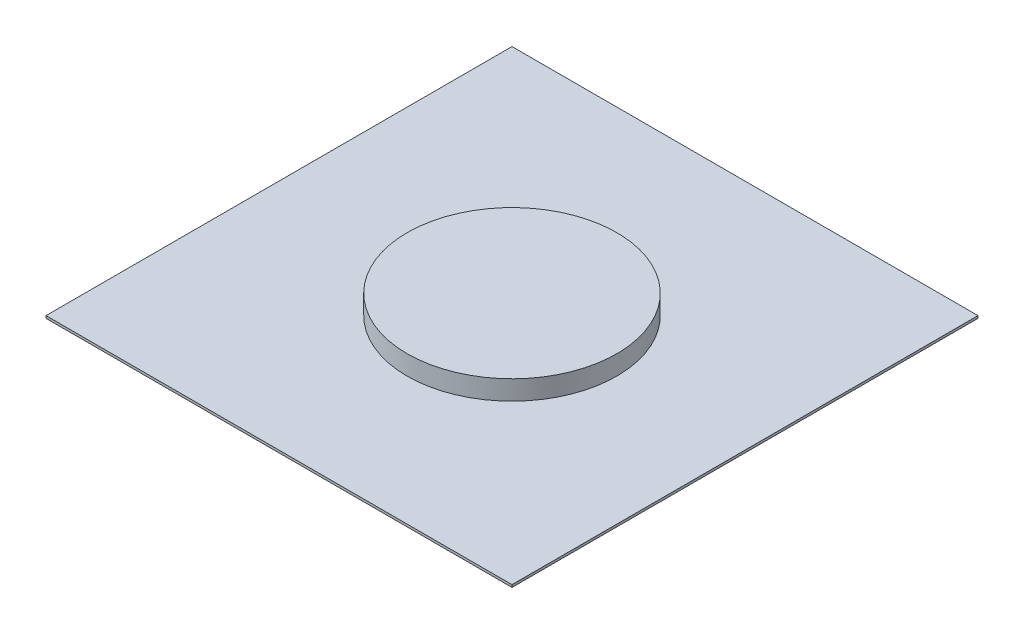
ISO-10303-21;
HEADER;
FILE_DESCRIPTION(('STEP AP214'),'2;1');
FILE_NAME('part.step','',(''),(''),'','','');
FILE_SCHEMA(('AUTOMOTIVE_DESIGN { 1 0 10303 214 1 1 1 1 }'));
ENDSEC;
DATA;
#1=APPLICATION_CONTEXT('core data for automotive mechanical design processes');
#2=APPLICATION_PROTOCOL_DEFINITION('international standard','automotive_design',2000,#1);
#3=PRODUCT_CONTEXT('',#1,'mechanical');
#4=PRODUCT('Part','Part','',(#3));
#5=PRODUCT_RELATED_PRODUCT_CATEGORY('part','',(#4));
#6=PRODUCT_DEFINITION_FORMATION('','',#4);
#7=PRODUCT_DEFINITION_CONTEXT('part definition',#1,'design');
#8=PRODUCT_DEFINITION('design','',#6,#7);
#9=PRODUCT_DEFINITION_SHAPE('','',#8);
#10=(LENGTH_UNIT() NAMED_UNIT(*) SI_UNIT(.MILLI.,.METRE.));
#11=(NAMED_UNIT(*) PLANE_ANGLE_UNIT() SI_UNIT($,.RADIAN.));
#12=(NAMED_UNIT(*) SI_UNIT($,.STERADIAN.) SOLID_ANGLE_UNIT());
#13=UNCERTAINTY_MEASURE_WITH_UNIT(LENGTH_MEASURE(1.E-05),#10,'distance_accuracy_value','');
#14=(GEOMETRIC_REPRESENTATION_CONTEXT(3) GLOBAL_UNCERTAINTY_ASSIGNED_CONTEXT((#13)) GLOBAL_UNIT_ASSIGNED_CONTEXT((#10,
#11,#12)) REPRESENTATION_CONTEXT('',''));
#15=CARTESIAN_POINT('',(0.,0.,0.));
#16=DIRECTION('',(0.,0.,1.));
#17=DIRECTION('',(1.,0.,0.));
#18=AXIS2_PLACEMENT_3D('',#15,#16,#17);
#19=CARTESIAN_POINT('',(0.,25.4,0.));
#20=DIRECTION('',(0.,-1.,0.));
#21=DIRECTION('',(0.,0.,-1.));
#22=AXIS2_PLACEMENT_3D('',#19,#20,#21);
#23=CYLINDRICAL_SURFACE('',#22,137.175010905379);
#24=CARTESIAN_POINT('',(0.,25.4,0.));
#25=DIRECTION('',(0.,1.,0.));
#26=DIRECTION('',(0.,0.,1.));
#27=AXIS2_PLACEMENT_3D('',#24,#25,#26);
#28=CIRCLE('',#27,137.175010905379);
#29=CARTESIAN_POINT('',(0.,25.4,137.175010905379));
#30=VERTEX_POINT('',#29);
#31=EDGE_CURVE('E11',#30,#30,#28,.T.);
#32=ORIENTED_EDGE('',*,*,#31,.F.);
#33=EDGE_LOOP('',(#32));
#34=FACE_BOUND('',#33,.T.);
#35=CARTESIAN_POINT('',(0.,0.,0.));
#36=DIRECTION('',(0.,1.,0.));
#37=DIRECTION('',(0.,0.,1.));
#38=AXIS2_PLACEMENT_3D('',#35,#36,#37);
#39=CIRCLE('',#38,137.175010905379);
#40=CARTESIAN_POINT('',(0.,0.,137.175010905379));
#41=VERTEX_POINT('',#40);
#42=EDGE_CURVE('E374',#41,#41,#39,.T.);
#43=ORIENTED_EDGE('',*,*,#42,.T.);
#44=EDGE_LOOP('',(#43));
#45=FACE_BOUND('',#44,.T.);
#46=ADVANCED_FACE('F368',(#34,#45),#23,.T.);
#47=CARTESIAN_POINT('',(0.,25.4,0.));
#48=DIRECTION('',(0.,1.,0.));
#49=DIRECTION('',(0.,0.,1.));
#50=AXIS2_PLACEMENT_3D('',#47,#48,#49);
#51=PLANE('',#50);
#52=ORIENTED_EDGE('',*,*,#31,.T.);
#53=EDGE_LOOP('',(#52));
#54=FACE_BOUND('',#53,.T.);
#55=ADVANCED_FACE('F383',(#54),#51,.T.);
#56=CARTESIAN_POINT('',(0.,0.,0.));
#57=DIRECTION('',(0.,1.,0.));
#58=DIRECTION('',(0.,0.,1.));
#59=AXIS2_PLACEMENT_3D('',#56,#57,#58);
#60=PLANE('',#59);
#61=ORIENTED_EDGE('',*,*,#42,.F.);
#62=EDGE_LOOP('',(#61));
#63=FACE_BOUND('',#62,.T.);
#64=ADVANCED_FACE('F381',(#63),#60,.F.);
#65=CLOSED_SHELL('',(#46,#55,#64));
#66=MANIFOLD_SOLID_BREP('B2',#65);
#67=CARTESIAN_POINT('',(-304.8,-3.175,-304.8));
#68=DIRECTION('',(-1.,0.,0.));
#69=DIRECTION('',(0.,0.,1.));
#70=AXIS2_PLACEMENT_3D('',#67,#68,#69);
#71=PLANE('',#70);
#72=DIRECTION('',(0.,0.,1.));
#73=VECTOR('',#72,1.);
#74=CARTESIAN_POINT('',(-304.8,0.,-304.8));
#75=LINE('',#74,#73);
#76=CARTESIAN_POINT('',(-304.8,0.,-304.8));
#77=VERTEX_POINT('',#76);
#78=CARTESIAN_POINT('',(-304.8,0.,304.8));
#79=VERTEX_POINT('',#78);
#80=EDGE_CURVE('E442',#77,#79,#75,.T.);
#81=ORIENTED_EDGE('',*,*,#80,.F.);
#82=DIRECTION('',(0.,1.,0.));
#83=VECTOR('',#82,1.);
#84=CARTESIAN_POINT('',(-304.8,-3.175,-304.8));
#85=LINE('',#84,#83);
#86=CARTESIAN_POINT('',(-304.8,-3.175,-304.8));
#87=VERTEX_POINT('',#86);
#88=EDGE_CURVE('E366',#87,#77,#85,.T.);
#89=ORIENTED_EDGE('',*,*,#88,.F.);
#90=DIRECTION('',(0.,0.,1.));
#91=VECTOR('',#90,1.);
#92=CARTESIAN_POINT('',(-304.8,-3.175,-304.8));
#93=LINE('',#92,#91);
#94=CARTESIAN_POINT('',(-304.8,-3.175,304.8));
#95=VERTEX_POINT('',#94);
#96=EDGE_CURVE('E444',#87,#95,#93,.T.);
#97=ORIENTED_EDGE('',*,*,#96,.T.);
#98=DIRECTION('',(0.,1.,0.));
#99=VECTOR('',#98,1.);
#100=CARTESIAN_POINT('',(-304.8,-3.175,304.8));
#101=LINE('',#100,#99);
#102=EDGE_CURVE('E405',#95,#79,#101,.T.);
#103=ORIENTED_EDGE('',*,*,#102,.T.);
#104=EDGE_LOOP('',(#81,#89,#97,#103));
#105=FACE_BOUND('',#104,.T.);
#106=ADVANCED_FACE('F402',(#105),#71,.T.);
#107=CARTESIAN_POINT('',(-304.8,-3.175,-304.8));
#108=DIRECTION('',(0.,0.,-1.));
#109=DIRECTION('',(-1.,0.,0.));
#110=AXIS2_PLACEMENT_3D('',#107,#108,#109);
#111=PLANE('',#110);
#112=DIRECTION('',(-1.,0.,0.));
#113=VECTOR('',#112,1.);
#114=CARTESIAN_POINT('',(-304.8,0.,-304.8));
#115=LINE('',#114,#113);
#116=CARTESIAN_POINT('',(304.8,0.,-304.8));
#117=VERTEX_POINT('',#116);
#118=EDGE_CURVE('E459',#117,#77,#115,.T.);
#119=ORIENTED_EDGE('',*,*,#118,.F.);
#120=DIRECTION('',(0.,1.,0.));
#121=VECTOR('',#120,1.);
#122=CARTESIAN_POINT('',(304.8,-3.175,-304.8));
#123=LINE('',#122,#121);
#124=CARTESIAN_POINT('',(304.8,-3.175,-304.8));
#125=VERTEX_POINT('',#124);
#126=EDGE_CURVE('E410',#125,#117,#123,.T.);
#127=ORIENTED_EDGE('',*,*,#126,.F.);
#128=DIRECTION('',(-1.,0.,0.));
#129=VECTOR('',#128,1.);
#130=CARTESIAN_POINT('',(-304.8,-3.175,-304.8));
#131=LINE('',#130,#129);
#132=EDGE_CURVE('E449',#125,#87,#131,.T.);
#133=ORIENTED_EDGE('',*,*,#132,.T.);
#134=ORIENTED_EDGE('',*,*,#88,.T.);
#135=EDGE_LOOP('',(#119,#127,#133,#134));
#136=FACE_BOUND('',#135,.T.);
#137=ADVANCED_FACE('F474',(#136),#111,.T.);
#138=CARTESIAN_POINT('',(304.8,-3.175,-304.8));
#139=DIRECTION('',(1.,0.,0.));
#140=DIRECTION('',(0.,0.,-1.));
#141=AXIS2_PLACEMENT_3D('',#138,#139,#140);
#142=PLANE('',#141);
#143=DIRECTION('',(0.,0.,-1.));
#144=VECTOR('',#143,1.);
#145=CARTESIAN_POINT('',(304.8,0.,-304.8));
#146=LINE('',#145,#144);
#147=CARTESIAN_POINT('',(304.8,0.,304.8));
#148=VERTEX_POINT('',#147);
#149=EDGE_CURVE('E456',#148,#117,#146,.T.);
#150=ORIENTED_EDGE('',*,*,#149,.F.);
#151=DIRECTION('',(0.,1.,0.));
#152=VECTOR('',#151,1.);
#153=CARTESIAN_POINT('',(304.8,-3.175,304.8));
#154=LINE('',#153,#152);
#155=CARTESIAN_POINT('',(304.8,-3.175,304.8));
#156=VERTEX_POINT('',#155);
#157=EDGE_CURVE('E448',#156,#148,#154,.T.);
#158=ORIENTED_EDGE('',*,*,#157,.F.);
#159=DIRECTION('',(0.,0.,-1.));
#160=VECTOR('',#159,1.);
#161=CARTESIAN_POINT('',(304.8,-3.175,-304.8));
#162=LINE('',#161,#160);
#163=EDGE_CURVE('E467',#156,#125,#162,.T.);
#164=ORIENTED_EDGE('',*,*,#163,.T.);
#165=ORIENTED_EDGE('',*,*,#126,.T.);
#166=EDGE_LOOP('',(#150,#158,#164,#165));
#167=FACE_BOUND('',#166,.T.);
#168=ADVANCED_FACE('F471',(#167),#142,.T.);
#169=CARTESIAN_POINT('',(-304.8,-3.175,304.8));
#170=DIRECTION('',(0.,0.,1.));
#171=DIRECTION('',(1.,0.,0.));
#172=AXIS2_PLACEMENT_3D('',#169,#170,#171);
#173=PLANE('',#172);
#174=DIRECTION('',(1.,0.,0.));
#175=VECTOR('',#174,1.);
#176=CARTESIAN_POINT('',(-304.8,0.,304.8));
#177=LINE('',#176,#175);
#178=EDGE_CURVE('E451',#79,#148,#177,.T.);
#179=ORIENTED_EDGE('',*,*,#178,.F.);
#180=ORIENTED_EDGE('',*,*,#102,.F.);
#181=DIRECTION('',(1.,0.,0.));
#182=VECTOR('',#181,1.);
#183=CARTESIAN_POINT('',(-304.8,-3.175,304.8));
#184=LINE('',#183,#182);
#185=EDGE_CURVE('E465',#95,#156,#184,.T.);
#186=ORIENTED_EDGE('',*,*,#185,.T.);
#187=ORIENTED_EDGE('',*,*,#157,.T.);
#188=EDGE_LOOP('',(#179,#180,#186,#187));
#189=FACE_BOUND('',#188,.T.);
#190=ADVANCED_FACE('F452',(#189),#173,.T.);
#191=CARTESIAN_POINT('',(-304.8,-3.175,304.8));
#192=DIRECTION('',(0.,1.,0.));
#193=DIRECTION('',(0.,0.,1.));
#194=AXIS2_PLACEMENT_3D('',#191,#192,#193);
#195=PLANE('',#194);
#196=ORIENTED_EDGE('',*,*,#96,.F.);
#197=ORIENTED_EDGE('',*,*,#132,.F.);
#198=ORIENTED_EDGE('',*,*,#163,.F.);
#199=ORIENTED_EDGE('',*,*,#185,.F.);
#200=EDGE_LOOP('',(#196,#197,#198,#199));
#201=FACE_BOUND('',#200,.T.);
#202=ADVANCED_FACE('F476',(#201),#195,.F.);
#203=CARTESIAN_POINT('',(-304.8,0.,304.8));
#204=DIRECTION('',(0.,1.,0.));
#205=DIRECTION('',(0.,0.,1.));
#206=AXIS2_PLACEMENT_3D('',#203,#204,#205);
#207=PLANE('',#206);
#208=ORIENTED_EDGE('',*,*,#80,.T.);
#209=ORIENTED_EDGE('',*,*,#178,.T.);
#210=ORIENTED_EDGE('',*,*,#149,.T.);
#211=ORIENTED_EDGE('',*,*,#118,.T.);
#212=EDGE_LOOP('',(#208,#209,#210,#211));
#213=FACE_BOUND('',#212,.T.);
#214=ADVANCED_FACE('F458',(#213),#207,.T.);
#215=CLOSED_SHELL('',(#106,#137,#168,#190,#202,#214));
#216=MANIFOLD_SOLID_BREP('B6',#215);
#217=ADVANCED_BREP_SHAPE_REPRESENTATION('',(#18,#66,#216),#14);
#218=SHAPE_DEFINITION_REPRESENTATION(#9,#217);
ENDSEC;
END-ISO-10303-21;
